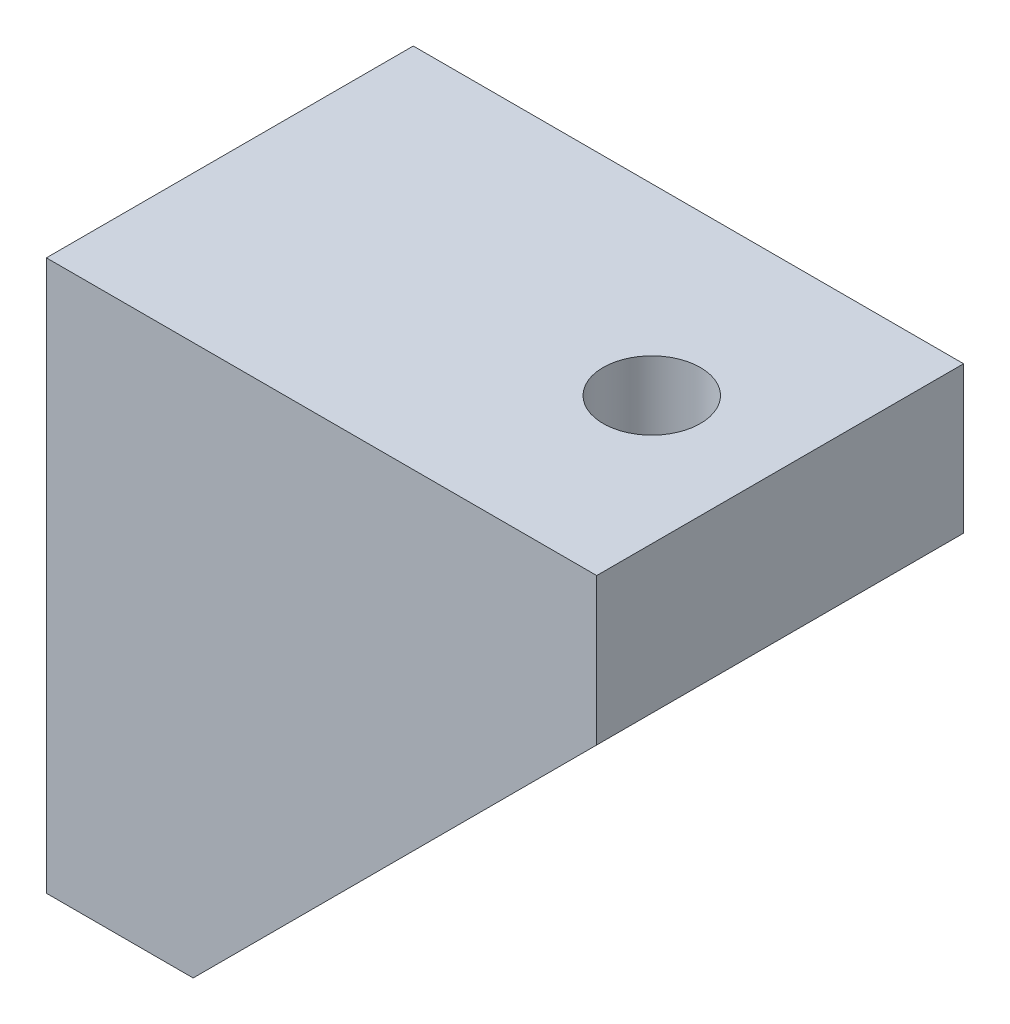
ISO-10303-21;
HEADER;
FILE_DESCRIPTION(('STEP AP214'),'2;1');
FILE_NAME('part.step','',(''),(''),'','','');
FILE_SCHEMA(('AUTOMOTIVE_DESIGN { 1 0 10303 214 1 1 1 1 }'));
ENDSEC;
DATA;
#1=APPLICATION_CONTEXT('core data for automotive mechanical design processes');
#2=APPLICATION_PROTOCOL_DEFINITION('international standard','automotive_design',2000,#1);
#3=PRODUCT_CONTEXT('',#1,'mechanical');
#4=PRODUCT('Part','Part','',(#3));
#5=PRODUCT_RELATED_PRODUCT_CATEGORY('part','',(#4));
#6=PRODUCT_DEFINITION_FORMATION('','',#4);
#7=PRODUCT_DEFINITION_CONTEXT('part definition',#1,'design');
#8=PRODUCT_DEFINITION('design','',#6,#7);
#9=PRODUCT_DEFINITION_SHAPE('','',#8);
#10=(LENGTH_UNIT() NAMED_UNIT(*) SI_UNIT(.MILLI.,.METRE.));
#11=(NAMED_UNIT(*) PLANE_ANGLE_UNIT() SI_UNIT($,.RADIAN.));
#12=(NAMED_UNIT(*) SI_UNIT($,.STERADIAN.) SOLID_ANGLE_UNIT());
#13=UNCERTAINTY_MEASURE_WITH_UNIT(LENGTH_MEASURE(1.E-05),#10,'distance_accuracy_value','');
#14=(GEOMETRIC_REPRESENTATION_CONTEXT(3) GLOBAL_UNCERTAINTY_ASSIGNED_CONTEXT((#13)) GLOBAL_UNIT_ASSIGNED_CONTEXT((#10,
#11,#12)) REPRESENTATION_CONTEXT('',''));
#15=CARTESIAN_POINT('',(0.,0.,0.));
#16=DIRECTION('',(0.,0.,1.));
#17=DIRECTION('',(1.,0.,0.));
#18=AXIS2_PLACEMENT_3D('',#15,#16,#17);
#19=CARTESIAN_POINT('',(0.,0.,4.));
#20=DIRECTION('',(0.,0.,-1.));
#21=DIRECTION('',(-1.,0.,0.));
#22=AXIS2_PLACEMENT_3D('',#19,#20,#21);
#23=PLANE('',#22);
#24=DIRECTION('',(1.,0.,0.));
#25=VECTOR('',#24,1.);
#26=CARTESIAN_POINT('',(8.,22.,4.));
#27=LINE('',#26,#25);
#28=CARTESIAN_POINT('',(8.,22.,4.));
#29=VERTEX_POINT('',#28);
#30=CARTESIAN_POINT('',(30.,22.,4.));
#31=VERTEX_POINT('',#30);
#32=EDGE_CURVE('E129',#29,#31,#27,.T.);
#33=ORIENTED_EDGE('',*,*,#32,.F.);
#34=DIRECTION('',(0.,1.,0.));
#35=VECTOR('',#34,1.);
#36=CARTESIAN_POINT('',(8.,0.,4.));
#37=LINE('',#36,#35);
#38=CARTESIAN_POINT('',(8.,0.,4.));
#39=VERTEX_POINT('',#38);
#40=EDGE_CURVE('E138',#39,#29,#37,.T.);
#41=ORIENTED_EDGE('',*,*,#40,.F.);
#42=DIRECTION('',(0.707106781186547,0.707106781186548,0.));
#43=VECTOR('',#42,1.);
#44=CARTESIAN_POINT('',(30.,22.,4.));
#45=LINE('',#44,#43);
#46=EDGE_CURVE('E54',#39,#31,#45,.T.);
#47=ORIENTED_EDGE('',*,*,#46,.T.);
#48=EDGE_LOOP('',(#33,#41,#47));
#49=FACE_BOUND('',#48,.T.);
#50=ADVANCED_FACE('F37',(#49),#23,.F.);
#51=CARTESIAN_POINT('',(8.,0.,4.));
#52=DIRECTION('',(0.,1.,0.));
#53=DIRECTION('',(0.,0.,1.));
#54=AXIS2_PLACEMENT_3D('',#51,#52,#53);
#55=PLANE('',#54);
#56=DIRECTION('',(1.,0.,0.));
#57=VECTOR('',#56,1.);
#58=CARTESIAN_POINT('',(8.,0.,0.));
#59=LINE('',#58,#57);
#60=CARTESIAN_POINT('',(0.,0.,0.));
#61=VERTEX_POINT('',#60);
#62=CARTESIAN_POINT('',(8.,0.,0.));
#63=VERTEX_POINT('',#62);
#64=EDGE_CURVE('E95',#61,#63,#59,.T.);
#65=ORIENTED_EDGE('',*,*,#64,.T.);
#66=DIRECTION('',(0.,0.,-1.));
#67=VECTOR('',#66,1.);
#68=CARTESIAN_POINT('',(8.,0.,4.));
#69=LINE('',#68,#67);
#70=EDGE_CURVE('E11',#39,#63,#69,.T.);
#71=ORIENTED_EDGE('',*,*,#70,.F.);
#72=DIRECTION('',(0.,0.,-1.));
#73=VECTOR('',#72,1.);
#74=CARTESIAN_POINT('',(8.,0.,16.));
#75=LINE('',#74,#73);
#76=CARTESIAN_POINT('',(8.,0.,16.));
#77=VERTEX_POINT('',#76);
#78=EDGE_CURVE('E103',#77,#39,#75,.T.);
#79=ORIENTED_EDGE('',*,*,#78,.F.);
#80=DIRECTION('',(0.,0.,-1.));
#81=VECTOR('',#80,1.);
#82=CARTESIAN_POINT('',(8.,0.,20.));
#83=LINE('',#82,#81);
#84=CARTESIAN_POINT('',(8.,0.,20.));
#85=VERTEX_POINT('',#84);
#86=EDGE_CURVE('E143',#85,#77,#83,.T.);
#87=ORIENTED_EDGE('',*,*,#86,.F.);
#88=DIRECTION('',(1.,0.,0.));
#89=VECTOR('',#88,1.);
#90=CARTESIAN_POINT('',(0.,0.,20.));
#91=LINE('',#90,#89);
#92=CARTESIAN_POINT('',(0.,0.,20.));
#93=VERTEX_POINT('',#92);
#94=EDGE_CURVE('E98',#93,#85,#91,.T.);
#95=ORIENTED_EDGE('',*,*,#94,.F.);
#96=DIRECTION('',(0.,0.,-1.));
#97=VECTOR('',#96,1.);
#98=CARTESIAN_POINT('',(0.,0.,4.));
#99=LINE('',#98,#97);
#100=EDGE_CURVE('E85',#93,#61,#99,.T.);
#101=ORIENTED_EDGE('',*,*,#100,.T.);
#102=EDGE_LOOP('',(#65,#71,#79,#87,#95,#101));
#103=FACE_BOUND('',#102,.T.);
#104=ADVANCED_FACE('F39',(#103),#55,.F.);
#105=CARTESIAN_POINT('',(30.,22.,4.));
#106=DIRECTION('',(-0.707106781186548,0.707106781186547,0.));
#107=DIRECTION('',(-0.707106781186547,-0.707106781186548,0.));
#108=AXIS2_PLACEMENT_3D('',#105,#106,#107);
#109=PLANE('',#108);
#110=DIRECTION('',(0.707106781186547,0.707106781186548,0.));
#111=VECTOR('',#110,1.);
#112=CARTESIAN_POINT('',(30.,22.,0.));
#113=LINE('',#112,#111);
#114=CARTESIAN_POINT('',(30.,22.,0.));
#115=VERTEX_POINT('',#114);
#116=EDGE_CURVE('E102',#63,#115,#113,.T.);
#117=ORIENTED_EDGE('',*,*,#116,.T.);
#118=DIRECTION('',(0.,0.,-1.));
#119=VECTOR('',#118,1.);
#120=CARTESIAN_POINT('',(30.,22.,4.));
#121=LINE('',#120,#119);
#122=EDGE_CURVE('E46',#31,#115,#121,.T.);
#123=ORIENTED_EDGE('',*,*,#122,.F.);
#124=ORIENTED_EDGE('',*,*,#46,.F.);
#125=ORIENTED_EDGE('',*,*,#70,.T.);
#126=EDGE_LOOP('',(#117,#123,#124,#125));
#127=FACE_BOUND('',#126,.T.);
#128=ADVANCED_FACE('F126',(#127),#109,.F.);
#129=CARTESIAN_POINT('',(30.,30.,4.));
#130=DIRECTION('',(-1.,0.,0.));
#131=DIRECTION('',(0.,-1.,0.));
#132=AXIS2_PLACEMENT_3D('',#129,#130,#131);
#133=PLANE('',#132);
#134=DIRECTION('',(0.,1.,0.));
#135=VECTOR('',#134,1.);
#136=CARTESIAN_POINT('',(30.,30.,0.));
#137=LINE('',#136,#135);
#138=CARTESIAN_POINT('',(30.,30.,0.));
#139=VERTEX_POINT('',#138);
#140=EDGE_CURVE('E105',#115,#139,#137,.T.);
#141=ORIENTED_EDGE('',*,*,#140,.T.);
#142=DIRECTION('',(0.,0.,-1.));
#143=VECTOR('',#142,1.);
#144=CARTESIAN_POINT('',(30.,30.,4.));
#145=LINE('',#144,#143);
#146=CARTESIAN_POINT('',(30.,30.,20.));
#147=VERTEX_POINT('',#146);
#148=EDGE_CURVE('E115',#147,#139,#145,.T.);
#149=ORIENTED_EDGE('',*,*,#148,.F.);
#150=DIRECTION('',(0.,1.,0.));
#151=VECTOR('',#150,1.);
#152=CARTESIAN_POINT('',(30.,22.,20.));
#153=LINE('',#152,#151);
#154=CARTESIAN_POINT('',(30.,22.,20.));
#155=VERTEX_POINT('',#154);
#156=EDGE_CURVE('E156',#155,#147,#153,.T.);
#157=ORIENTED_EDGE('',*,*,#156,.F.);
#158=DIRECTION('',(0.,0.,-1.));
#159=VECTOR('',#158,1.);
#160=CARTESIAN_POINT('',(30.,22.,20.));
#161=LINE('',#160,#159);
#162=CARTESIAN_POINT('',(30.,22.,16.));
#163=VERTEX_POINT('',#162);
#164=EDGE_CURVE('E154',#155,#163,#161,.T.);
#165=ORIENTED_EDGE('',*,*,#164,.T.);
#166=DIRECTION('',(0.,0.,-1.));
#167=VECTOR('',#166,1.);
#168=CARTESIAN_POINT('',(30.,22.,16.));
#169=LINE('',#168,#167);
#170=EDGE_CURVE('E123',#163,#31,#169,.T.);
#171=ORIENTED_EDGE('',*,*,#170,.T.);
#172=ORIENTED_EDGE('',*,*,#122,.T.);
#173=EDGE_LOOP('',(#141,#149,#157,#165,#171,#172));
#174=FACE_BOUND('',#173,.T.);
#175=ADVANCED_FACE('F119',(#174),#133,.F.);
#176=CARTESIAN_POINT('',(0.,30.,4.));
#177=DIRECTION('',(0.,-1.,0.));
#178=DIRECTION('',(0.,0.,-1.));
#179=AXIS2_PLACEMENT_3D('',#176,#177,#178);
#180=PLANE('',#179);
#181=CARTESIAN_POINT('',(23.,30.,10.));
#182=DIRECTION('',(0.,-1.,0.));
#183=DIRECTION('',(0.,0.,-1.));
#184=AXIS2_PLACEMENT_3D('',#181,#182,#183);
#185=CIRCLE('',#184,2.65);
#186=CARTESIAN_POINT('',(23.,30.,7.35));
#187=VERTEX_POINT('',#186);
#188=EDGE_CURVE('E174',#187,#187,#185,.T.);
#189=ORIENTED_EDGE('',*,*,#188,.T.);
#190=EDGE_LOOP('',(#189));
#191=FACE_BOUND('',#190,.T.);
#192=DIRECTION('',(-1.,0.,0.));
#193=VECTOR('',#192,1.);
#194=CARTESIAN_POINT('',(0.,30.,0.));
#195=LINE('',#194,#193);
#196=CARTESIAN_POINT('',(0.,30.,0.));
#197=VERTEX_POINT('',#196);
#198=EDGE_CURVE('E74',#139,#197,#195,.T.);
#199=ORIENTED_EDGE('',*,*,#198,.T.);
#200=DIRECTION('',(0.,0.,-1.));
#201=VECTOR('',#200,1.);
#202=CARTESIAN_POINT('',(0.,30.,4.));
#203=LINE('',#202,#201);
#204=CARTESIAN_POINT('',(0.,30.,20.));
#205=VERTEX_POINT('',#204);
#206=EDGE_CURVE('E87',#205,#197,#203,.T.);
#207=ORIENTED_EDGE('',*,*,#206,.F.);
#208=DIRECTION('',(-1.,0.,0.));
#209=VECTOR('',#208,1.);
#210=CARTESIAN_POINT('',(30.,30.,20.));
#211=LINE('',#210,#209);
#212=EDGE_CURVE('E159',#147,#205,#211,.T.);
#213=ORIENTED_EDGE('',*,*,#212,.F.);
#214=ORIENTED_EDGE('',*,*,#148,.T.);
#215=EDGE_LOOP('',(#199,#207,#213,#214));
#216=FACE_BOUND('',#215,.T.);
#217=ADVANCED_FACE('F183',(#191,#216),#180,.F.);
#218=CARTESIAN_POINT('',(0.,0.,4.));
#219=DIRECTION('',(1.,0.,0.));
#220=DIRECTION('',(0.,0.,-1.));
#221=AXIS2_PLACEMENT_3D('',#218,#219,#220);
#222=PLANE('',#221);
#223=CARTESIAN_POINT('',(0.,11.,10.));
#224=DIRECTION('',(1.,0.,0.));
#225=DIRECTION('',(0.,0.,-1.));
#226=AXIS2_PLACEMENT_3D('',#223,#224,#225);
#227=CIRCLE('',#226,2.65);
#228=CARTESIAN_POINT('',(0.,11.,7.35));
#229=VERTEX_POINT('',#228);
#230=EDGE_CURVE('E160',#229,#229,#227,.T.);
#231=ORIENTED_EDGE('',*,*,#230,.T.);
#232=EDGE_LOOP('',(#231));
#233=FACE_BOUND('',#232,.T.);
#234=DIRECTION('',(0.,-1.,0.));
#235=VECTOR('',#234,1.);
#236=CARTESIAN_POINT('',(0.,0.,0.));
#237=LINE('',#236,#235);
#238=EDGE_CURVE('E80',#197,#61,#237,.T.);
#239=ORIENTED_EDGE('',*,*,#238,.T.);
#240=ORIENTED_EDGE('',*,*,#100,.F.);
#241=DIRECTION('',(0.,-1.,0.));
#242=VECTOR('',#241,1.);
#243=CARTESIAN_POINT('',(0.,30.,20.));
#244=LINE('',#243,#242);
#245=EDGE_CURVE('E167',#205,#93,#244,.T.);
#246=ORIENTED_EDGE('',*,*,#245,.F.);
#247=ORIENTED_EDGE('',*,*,#206,.T.);
#248=EDGE_LOOP('',(#239,#240,#246,#247));
#249=FACE_BOUND('',#248,.T.);
#250=ADVANCED_FACE('F82',(#233,#249),#222,.F.);
#251=CARTESIAN_POINT('',(0.,0.,0.));
#252=DIRECTION('',(0.,0.,-1.));
#253=DIRECTION('',(-1.,0.,0.));
#254=AXIS2_PLACEMENT_3D('',#251,#252,#253);
#255=PLANE('',#254);
#256=ORIENTED_EDGE('',*,*,#64,.F.);
#257=ORIENTED_EDGE('',*,*,#238,.F.);
#258=ORIENTED_EDGE('',*,*,#198,.F.);
#259=ORIENTED_EDGE('',*,*,#140,.F.);
#260=ORIENTED_EDGE('',*,*,#116,.F.);
#261=EDGE_LOOP('',(#256,#257,#258,#259,#260));
#262=FACE_BOUND('',#261,.T.);
#263=ADVANCED_FACE('F100',(#262),#255,.T.);
#264=CARTESIAN_POINT('',(8.,0.,16.));
#265=DIRECTION('',(-1.,0.,0.));
#266=DIRECTION('',(0.,0.,1.));
#267=AXIS2_PLACEMENT_3D('',#264,#265,#266);
#268=PLANE('',#267);
#269=CARTESIAN_POINT('',(8.,11.,10.));
#270=DIRECTION('',(1.,0.,0.));
#271=DIRECTION('',(0.,0.,-1.));
#272=AXIS2_PLACEMENT_3D('',#269,#270,#271);
#273=CIRCLE('',#272,2.65);
#274=CARTESIAN_POINT('',(8.,11.,7.35));
#275=VERTEX_POINT('',#274);
#276=EDGE_CURVE('E171',#275,#275,#273,.T.);
#277=ORIENTED_EDGE('',*,*,#276,.F.);
#278=EDGE_LOOP('',(#277));
#279=FACE_BOUND('',#278,.T.);
#280=ORIENTED_EDGE('',*,*,#40,.T.);
#281=DIRECTION('',(0.,0.,-1.));
#282=VECTOR('',#281,1.);
#283=CARTESIAN_POINT('',(8.,22.,16.));
#284=LINE('',#283,#282);
#285=CARTESIAN_POINT('',(8.,22.,16.));
#286=VERTEX_POINT('',#285);
#287=EDGE_CURVE('E108',#286,#29,#284,.T.);
#288=ORIENTED_EDGE('',*,*,#287,.F.);
#289=DIRECTION('',(0.,1.,0.));
#290=VECTOR('',#289,1.);
#291=CARTESIAN_POINT('',(8.,0.,16.));
#292=LINE('',#291,#290);
#293=EDGE_CURVE('E137',#77,#286,#292,.T.);
#294=ORIENTED_EDGE('',*,*,#293,.F.);
#295=ORIENTED_EDGE('',*,*,#78,.T.);
#296=EDGE_LOOP('',(#280,#288,#294,#295));
#297=FACE_BOUND('',#296,.T.);
#298=ADVANCED_FACE('F194',(#279,#297),#268,.F.);
#299=CARTESIAN_POINT('',(8.,22.,16.));
#300=DIRECTION('',(0.,1.,0.));
#301=DIRECTION('',(0.,0.,1.));
#302=AXIS2_PLACEMENT_3D('',#299,#300,#301);
#303=PLANE('',#302);
#304=CARTESIAN_POINT('',(23.,22.,10.));
#305=DIRECTION('',(0.,-1.,0.));
#306=DIRECTION('',(0.,0.,-1.));
#307=AXIS2_PLACEMENT_3D('',#304,#305,#306);
#308=CIRCLE('',#307,2.65);
#309=CARTESIAN_POINT('',(23.,22.,7.35));
#310=VERTEX_POINT('',#309);
#311=EDGE_CURVE('E177',#310,#310,#308,.T.);
#312=ORIENTED_EDGE('',*,*,#311,.F.);
#313=EDGE_LOOP('',(#312));
#314=FACE_BOUND('',#313,.T.);
#315=ORIENTED_EDGE('',*,*,#32,.T.);
#316=ORIENTED_EDGE('',*,*,#170,.F.);
#317=DIRECTION('',(1.,0.,0.));
#318=VECTOR('',#317,1.);
#319=CARTESIAN_POINT('',(8.,22.,16.));
#320=LINE('',#319,#318);
#321=EDGE_CURVE('E141',#286,#163,#320,.T.);
#322=ORIENTED_EDGE('',*,*,#321,.F.);
#323=ORIENTED_EDGE('',*,*,#287,.T.);
#324=EDGE_LOOP('',(#315,#316,#322,#323));
#325=FACE_BOUND('',#324,.T.);
#326=ADVANCED_FACE('F130',(#314,#325),#303,.F.);
#327=CARTESIAN_POINT('',(0.,0.,16.));
#328=DIRECTION('',(0.,0.,1.));
#329=DIRECTION('',(1.,0.,0.));
#330=AXIS2_PLACEMENT_3D('',#327,#328,#329);
#331=PLANE('',#330);
#332=DIRECTION('',(0.707106781186547,0.707106781186548,0.));
#333=VECTOR('',#332,1.);
#334=CARTESIAN_POINT('',(8.,0.,16.));
#335=LINE('',#334,#333);
#336=EDGE_CURVE('E157',#77,#163,#335,.T.);
#337=ORIENTED_EDGE('',*,*,#336,.F.);
#338=ORIENTED_EDGE('',*,*,#293,.T.);
#339=ORIENTED_EDGE('',*,*,#321,.T.);
#340=EDGE_LOOP('',(#337,#338,#339));
#341=FACE_BOUND('',#340,.T.);
#342=ADVANCED_FACE('F193',(#341),#331,.F.);
#343=CARTESIAN_POINT('',(8.,0.,20.));
#344=DIRECTION('',(-0.707106781186548,0.707106781186547,0.));
#345=DIRECTION('',(-0.707106781186547,-0.707106781186548,0.));
#346=AXIS2_PLACEMENT_3D('',#343,#344,#345);
#347=PLANE('',#346);
#348=ORIENTED_EDGE('',*,*,#336,.T.);
#349=ORIENTED_EDGE('',*,*,#164,.F.);
#350=DIRECTION('',(0.707106781186547,0.707106781186548,0.));
#351=VECTOR('',#350,1.);
#352=CARTESIAN_POINT('',(8.,0.,20.));
#353=LINE('',#352,#351);
#354=EDGE_CURVE('E163',#85,#155,#353,.T.);
#355=ORIENTED_EDGE('',*,*,#354,.F.);
#356=ORIENTED_EDGE('',*,*,#86,.T.);
#357=EDGE_LOOP('',(#348,#349,#355,#356));
#358=FACE_BOUND('',#357,.T.);
#359=ADVANCED_FACE('F200',(#358),#347,.F.);
#360=CARTESIAN_POINT('',(0.,0.,20.));
#361=DIRECTION('',(0.,0.,1.));
#362=DIRECTION('',(1.,0.,0.));
#363=AXIS2_PLACEMENT_3D('',#360,#361,#362);
#364=PLANE('',#363);
#365=ORIENTED_EDGE('',*,*,#212,.T.);
#366=ORIENTED_EDGE('',*,*,#245,.T.);
#367=ORIENTED_EDGE('',*,*,#94,.T.);
#368=ORIENTED_EDGE('',*,*,#354,.T.);
#369=ORIENTED_EDGE('',*,*,#156,.T.);
#370=EDGE_LOOP('',(#365,#366,#367,#368,#369));
#371=FACE_BOUND('',#370,.T.);
#372=ADVANCED_FACE('F257',(#371),#364,.T.);
#373=CARTESIAN_POINT('',(0.,11.,10.));
#374=DIRECTION('',(1.,0.,0.));
#375=DIRECTION('',(0.,0.,-1.));
#376=AXIS2_PLACEMENT_3D('',#373,#374,#375);
#377=CYLINDRICAL_SURFACE('',#376,2.65);
#378=ORIENTED_EDGE('',*,*,#230,.F.);
#379=EDGE_LOOP('',(#378));
#380=FACE_BOUND('',#379,.T.);
#381=ORIENTED_EDGE('',*,*,#276,.T.);
#382=EDGE_LOOP('',(#381));
#383=FACE_BOUND('',#382,.T.);
#384=ADVANCED_FACE('F188',(#380,#383),#377,.F.);
#385=CARTESIAN_POINT('',(23.,30.,10.));
#386=DIRECTION('',(0.,-1.,0.));
#387=DIRECTION('',(0.,0.,-1.));
#388=AXIS2_PLACEMENT_3D('',#385,#386,#387);
#389=CYLINDRICAL_SURFACE('',#388,2.65);
#390=ORIENTED_EDGE('',*,*,#188,.F.);
#391=EDGE_LOOP('',(#390));
#392=FACE_BOUND('',#391,.T.);
#393=ORIENTED_EDGE('',*,*,#311,.T.);
#394=EDGE_LOOP('',(#393));
#395=FACE_BOUND('',#394,.T.);
#396=ADVANCED_FACE('F185',(#392,#395),#389,.F.);
#397=CLOSED_SHELL('',(#50,#104,#128,#175,#217,#250,#263,#298,#326,#342,#359,#372,#384,#396));
#398=MANIFOLD_SOLID_BREP('B2',#397);
#399=ADVANCED_BREP_SHAPE_REPRESENTATION('',(#18,#398),#14);
#400=SHAPE_DEFINITION_REPRESENTATION(#9,#399);
ENDSEC;
END-ISO-10303-21;
